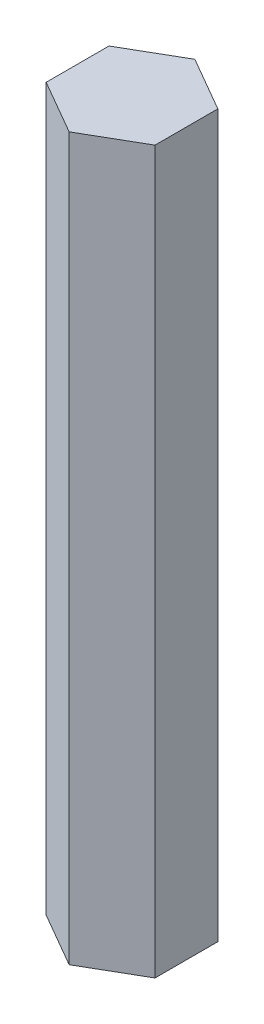
ISO-10303-21;
HEADER;
FILE_DESCRIPTION(('STEP AP214'),'2;1');
FILE_NAME('part.step','',(''),(''),'','','');
FILE_SCHEMA(('AUTOMOTIVE_DESIGN { 1 0 10303 214 1 1 1 1 }'));
ENDSEC;
DATA;
#1=APPLICATION_CONTEXT('core data for automotive mechanical design processes');
#2=APPLICATION_PROTOCOL_DEFINITION('international standard','automotive_design',2000,#1);
#3=PRODUCT_CONTEXT('',#1,'mechanical');
#4=PRODUCT('Part','Part','',(#3));
#5=PRODUCT_RELATED_PRODUCT_CATEGORY('part','',(#4));
#6=PRODUCT_DEFINITION_FORMATION('','',#4);
#7=PRODUCT_DEFINITION_CONTEXT('part definition',#1,'design');
#8=PRODUCT_DEFINITION('design','',#6,#7);
#9=PRODUCT_DEFINITION_SHAPE('','',#8);
#10=(LENGTH_UNIT() NAMED_UNIT(*) SI_UNIT(.MILLI.,.METRE.));
#11=(NAMED_UNIT(*) PLANE_ANGLE_UNIT() SI_UNIT($,.RADIAN.));
#12=(NAMED_UNIT(*) SI_UNIT($,.STERADIAN.) SOLID_ANGLE_UNIT());
#13=UNCERTAINTY_MEASURE_WITH_UNIT(LENGTH_MEASURE(1.E-05),#10,'distance_accuracy_value','');
#14=(GEOMETRIC_REPRESENTATION_CONTEXT(3) GLOBAL_UNCERTAINTY_ASSIGNED_CONTEXT((#13)) GLOBAL_UNIT_ASSIGNED_CONTEXT((#10,
#11,#12)) REPRESENTATION_CONTEXT('',''));
#15=CARTESIAN_POINT('',(0.,0.,0.));
#16=DIRECTION('',(0.,0.,1.));
#17=DIRECTION('',(1.,0.,0.));
#18=AXIS2_PLACEMENT_3D('',#15,#16,#17);
#19=CARTESIAN_POINT('',(3.79449030668152,33.528,-3.65125));
#20=DIRECTION('',(-0.5,0.,0.866025403784439));
#21=DIRECTION('',(0.866025403784439,0.,0.5));
#22=AXIS2_PLACEMENT_3D('',#19,#20,#21);
#23=PLANE('',#22);
#24=DIRECTION('',(-0.866025403784439,0.,-0.5));
#25=VECTOR('',#24,1.);
#26=CARTESIAN_POINT('',(3.79449030668152,0.,-3.65125));
#27=LINE('',#26,#25);
#28=CARTESIAN_POINT('',(3.79449030668152,0.,-3.65125));
#29=VERTEX_POINT('',#28);
#30=CARTESIAN_POINT('',(1.26483010222717,0.,-5.11175));
#31=VERTEX_POINT('',#30);
#32=EDGE_CURVE('E116',#29,#31,#27,.T.);
#33=ORIENTED_EDGE('',*,*,#32,.T.);
#34=DIRECTION('',(0.,-1.,0.));
#35=VECTOR('',#34,1.);
#36=CARTESIAN_POINT('',(1.26483010222717,33.528,-5.11175));
#37=LINE('',#36,#35);
#38=CARTESIAN_POINT('',(1.26483010222717,33.528,-5.11175));
#39=VERTEX_POINT('',#38);
#40=EDGE_CURVE('E11',#39,#31,#37,.T.);
#41=ORIENTED_EDGE('',*,*,#40,.F.);
#42=DIRECTION('',(-0.866025403784439,0.,-0.5));
#43=VECTOR('',#42,1.);
#44=CARTESIAN_POINT('',(3.79449030668152,33.528,-3.65125));
#45=LINE('',#44,#43);
#46=CARTESIAN_POINT('',(3.79449030668152,33.528,-3.65125));
#47=VERTEX_POINT('',#46);
#48=EDGE_CURVE('E126',#47,#39,#45,.T.);
#49=ORIENTED_EDGE('',*,*,#48,.F.);
#50=DIRECTION('',(0.,-1.,0.));
#51=VECTOR('',#50,1.);
#52=CARTESIAN_POINT('',(3.79449030668152,33.528,-3.65125));
#53=LINE('',#52,#51);
#54=EDGE_CURVE('E112',#47,#29,#53,.T.);
#55=ORIENTED_EDGE('',*,*,#54,.T.);
#56=EDGE_LOOP('',(#33,#41,#49,#55));
#57=FACE_BOUND('',#56,.T.);
#58=ADVANCED_FACE('F32',(#57),#23,.F.);
#59=CARTESIAN_POINT('',(1.26483010222717,33.528,-5.11175));
#60=DIRECTION('',(0.5,0.,0.866025403784439));
#61=DIRECTION('',(0.866025403784439,0.,-0.5));
#62=AXIS2_PLACEMENT_3D('',#59,#60,#61);
#63=PLANE('',#62);
#64=DIRECTION('',(-0.866025403784439,0.,0.5));
#65=VECTOR('',#64,1.);
#66=CARTESIAN_POINT('',(1.26483010222717,0.,-5.11175));
#67=LINE('',#66,#65);
#68=CARTESIAN_POINT('',(-1.26483010222717,0.,-3.65125));
#69=VERTEX_POINT('',#68);
#70=EDGE_CURVE('E119',#31,#69,#67,.T.);
#71=ORIENTED_EDGE('',*,*,#70,.T.);
#72=DIRECTION('',(0.,-1.,0.));
#73=VECTOR('',#72,1.);
#74=CARTESIAN_POINT('',(-1.26483010222717,33.528,-3.65125));
#75=LINE('',#74,#73);
#76=CARTESIAN_POINT('',(-1.26483010222717,33.528,-3.65125));
#77=VERTEX_POINT('',#76);
#78=EDGE_CURVE('E40',#77,#69,#75,.T.);
#79=ORIENTED_EDGE('',*,*,#78,.F.);
#80=DIRECTION('',(-0.866025403784439,0.,0.5));
#81=VECTOR('',#80,1.);
#82=CARTESIAN_POINT('',(1.26483010222717,33.528,-5.11175));
#83=LINE('',#82,#81);
#84=EDGE_CURVE('E85',#39,#77,#83,.T.);
#85=ORIENTED_EDGE('',*,*,#84,.F.);
#86=ORIENTED_EDGE('',*,*,#40,.T.);
#87=EDGE_LOOP('',(#71,#79,#85,#86));
#88=FACE_BOUND('',#87,.T.);
#89=ADVANCED_FACE('F150',(#88),#63,.F.);
#90=CARTESIAN_POINT('',(-1.26483010222717,33.528,-3.65125));
#91=DIRECTION('',(1.,0.,0.));
#92=DIRECTION('',(0.,0.,-1.));
#93=AXIS2_PLACEMENT_3D('',#90,#91,#92);
#94=PLANE('',#93);
#95=DIRECTION('',(0.,0.,1.));
#96=VECTOR('',#95,1.);
#97=CARTESIAN_POINT('',(-1.26483010222717,0.,-3.65125));
#98=LINE('',#97,#96);
#99=CARTESIAN_POINT('',(-1.26483010222717,0.,-0.73025));
#100=VERTEX_POINT('',#99);
#101=EDGE_CURVE('E121',#69,#100,#98,.T.);
#102=ORIENTED_EDGE('',*,*,#101,.T.);
#103=DIRECTION('',(0.,-1.,0.));
#104=VECTOR('',#103,1.);
#105=CARTESIAN_POINT('',(-1.26483010222717,33.528,-0.73025));
#106=LINE('',#105,#104);
#107=CARTESIAN_POINT('',(-1.26483010222717,33.528,-0.73025));
#108=VERTEX_POINT('',#107);
#109=EDGE_CURVE('E107',#108,#100,#106,.T.);
#110=ORIENTED_EDGE('',*,*,#109,.F.);
#111=DIRECTION('',(0.,0.,1.));
#112=VECTOR('',#111,1.);
#113=CARTESIAN_POINT('',(-1.26483010222717,33.528,-3.65125));
#114=LINE('',#113,#112);
#115=EDGE_CURVE('E98',#77,#108,#114,.T.);
#116=ORIENTED_EDGE('',*,*,#115,.F.);
#117=ORIENTED_EDGE('',*,*,#78,.T.);
#118=EDGE_LOOP('',(#102,#110,#116,#117));
#119=FACE_BOUND('',#118,.T.);
#120=ADVANCED_FACE('F132',(#119),#94,.F.);
#121=CARTESIAN_POINT('',(-1.26483010222717,33.528,-0.73025));
#122=DIRECTION('',(0.5,0.,-0.866025403784439));
#123=DIRECTION('',(-0.866025403784439,0.,-0.5));
#124=AXIS2_PLACEMENT_3D('',#121,#122,#123);
#125=PLANE('',#124);
#126=DIRECTION('',(0.866025403784439,0.,0.5));
#127=VECTOR('',#126,1.);
#128=CARTESIAN_POINT('',(-1.26483010222717,0.,-0.73025));
#129=LINE('',#128,#127);
#130=CARTESIAN_POINT('',(1.26483010222717,0.,0.73025));
#131=VERTEX_POINT('',#130);
#132=EDGE_CURVE('E106',#100,#131,#129,.T.);
#133=ORIENTED_EDGE('',*,*,#132,.T.);
#134=DIRECTION('',(0.,-1.,0.));
#135=VECTOR('',#134,1.);
#136=CARTESIAN_POINT('',(1.26483010222717,33.528,0.73025));
#137=LINE('',#136,#135);
#138=CARTESIAN_POINT('',(1.26483010222717,33.528,0.73025));
#139=VERTEX_POINT('',#138);
#140=EDGE_CURVE('E103',#139,#131,#137,.T.);
#141=ORIENTED_EDGE('',*,*,#140,.F.);
#142=DIRECTION('',(0.866025403784439,0.,0.5));
#143=VECTOR('',#142,1.);
#144=CARTESIAN_POINT('',(-1.26483010222717,33.528,-0.73025));
#145=LINE('',#144,#143);
#146=EDGE_CURVE('E92',#108,#139,#145,.T.);
#147=ORIENTED_EDGE('',*,*,#146,.F.);
#148=ORIENTED_EDGE('',*,*,#109,.T.);
#149=EDGE_LOOP('',(#133,#141,#147,#148));
#150=FACE_BOUND('',#149,.T.);
#151=ADVANCED_FACE('F104',(#150),#125,.F.);
#152=CARTESIAN_POINT('',(1.26483010222717,33.528,0.73025));
#153=DIRECTION('',(-0.5,0.,-0.866025403784439));
#154=DIRECTION('',(-0.866025403784439,0.,0.5));
#155=AXIS2_PLACEMENT_3D('',#152,#153,#154);
#156=PLANE('',#155);
#157=DIRECTION('',(0.866025403784439,0.,-0.5));
#158=VECTOR('',#157,1.);
#159=CARTESIAN_POINT('',(1.26483010222717,0.,0.73025));
#160=LINE('',#159,#158);
#161=CARTESIAN_POINT('',(3.79449030668152,0.,-0.73025));
#162=VERTEX_POINT('',#161);
#163=EDGE_CURVE('E71',#131,#162,#160,.T.);
#164=ORIENTED_EDGE('',*,*,#163,.T.);
#165=DIRECTION('',(0.,-1.,0.));
#166=VECTOR('',#165,1.);
#167=CARTESIAN_POINT('',(3.79449030668152,33.528,-0.73025));
#168=LINE('',#167,#166);
#169=CARTESIAN_POINT('',(3.79449030668152,33.528,-0.73025));
#170=VERTEX_POINT('',#169);
#171=EDGE_CURVE('E108',#170,#162,#168,.T.);
#172=ORIENTED_EDGE('',*,*,#171,.F.);
#173=DIRECTION('',(0.866025403784439,0.,-0.5));
#174=VECTOR('',#173,1.);
#175=CARTESIAN_POINT('',(1.26483010222717,33.528,0.73025));
#176=LINE('',#175,#174);
#177=EDGE_CURVE('E96',#139,#170,#176,.T.);
#178=ORIENTED_EDGE('',*,*,#177,.F.);
#179=ORIENTED_EDGE('',*,*,#140,.T.);
#180=EDGE_LOOP('',(#164,#172,#178,#179));
#181=FACE_BOUND('',#180,.T.);
#182=ADVANCED_FACE('F110',(#181),#156,.F.);
#183=CARTESIAN_POINT('',(3.79449030668152,33.528,-0.73025));
#184=DIRECTION('',(-1.,0.,0.));
#185=DIRECTION('',(0.,0.,1.));
#186=AXIS2_PLACEMENT_3D('',#183,#184,#185);
#187=PLANE('',#186);
#188=DIRECTION('',(0.,0.,-1.));
#189=VECTOR('',#188,1.);
#190=CARTESIAN_POINT('',(3.79449030668152,0.,-0.73025));
#191=LINE('',#190,#189);
#192=EDGE_CURVE('E77',#162,#29,#191,.T.);
#193=ORIENTED_EDGE('',*,*,#192,.T.);
#194=ORIENTED_EDGE('',*,*,#54,.F.);
#195=DIRECTION('',(0.,0.,-1.));
#196=VECTOR('',#195,1.);
#197=CARTESIAN_POINT('',(3.79449030668152,33.528,-0.73025));
#198=LINE('',#197,#196);
#199=EDGE_CURVE('E48',#170,#47,#198,.T.);
#200=ORIENTED_EDGE('',*,*,#199,.F.);
#201=ORIENTED_EDGE('',*,*,#171,.T.);
#202=EDGE_LOOP('',(#193,#194,#200,#201));
#203=FACE_BOUND('',#202,.T.);
#204=ADVANCED_FACE('F139',(#203),#187,.F.);
#205=CARTESIAN_POINT('',(0.,33.528,0.));
#206=DIRECTION('',(0.,1.,0.));
#207=DIRECTION('',(0.,0.,1.));
#208=AXIS2_PLACEMENT_3D('',#205,#206,#207);
#209=PLANE('',#208);
#210=ORIENTED_EDGE('',*,*,#48,.T.);
#211=ORIENTED_EDGE('',*,*,#84,.T.);
#212=ORIENTED_EDGE('',*,*,#115,.T.);
#213=ORIENTED_EDGE('',*,*,#146,.T.);
#214=ORIENTED_EDGE('',*,*,#177,.T.);
#215=ORIENTED_EDGE('',*,*,#199,.T.);
#216=EDGE_LOOP('',(#210,#211,#212,#213,#214,#215));
#217=FACE_BOUND('',#216,.T.);
#218=ADVANCED_FACE('F94',(#217),#209,.T.);
#219=CARTESIAN_POINT('',(0.,0.,0.));
#220=DIRECTION('',(0.,1.,0.));
#221=DIRECTION('',(0.,0.,1.));
#222=AXIS2_PLACEMENT_3D('',#219,#220,#221);
#223=PLANE('',#222);
#224=ORIENTED_EDGE('',*,*,#32,.F.);
#225=ORIENTED_EDGE('',*,*,#192,.F.);
#226=ORIENTED_EDGE('',*,*,#163,.F.);
#227=ORIENTED_EDGE('',*,*,#132,.F.);
#228=ORIENTED_EDGE('',*,*,#101,.F.);
#229=ORIENTED_EDGE('',*,*,#70,.F.);
#230=EDGE_LOOP('',(#224,#225,#226,#227,#228,#229));
#231=FACE_BOUND('',#230,.T.);
#232=ADVANCED_FACE('F135',(#231),#223,.F.);
#233=CLOSED_SHELL('',(#58,#89,#120,#151,#182,#204,#218,#232));
#234=MANIFOLD_SOLID_BREP('B2',#233);
#235=ADVANCED_BREP_SHAPE_REPRESENTATION('',(#18,#234),#14);
#236=SHAPE_DEFINITION_REPRESENTATION(#9,#235);
ENDSEC;
END-ISO-10303-21;
